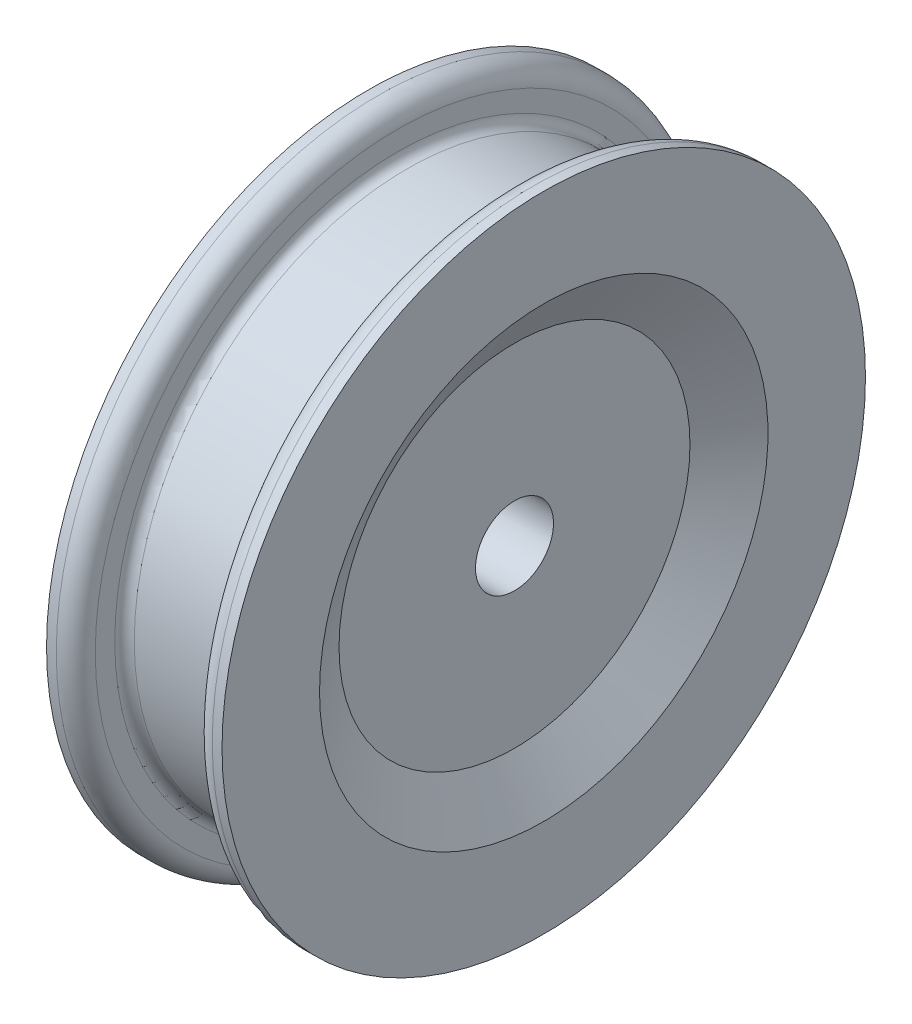
ISO-10303-21;
HEADER;
FILE_DESCRIPTION(('STEP AP214'),'2;1');
FILE_NAME('part.step','',(''),(''),'','','');
FILE_SCHEMA(('AUTOMOTIVE_DESIGN { 1 0 10303 214 1 1 1 1 }'));
ENDSEC;
DATA;
#1=APPLICATION_CONTEXT('core data for automotive mechanical design processes');
#2=APPLICATION_PROTOCOL_DEFINITION('international standard','automotive_design',2000,#1);
#3=PRODUCT_CONTEXT('',#1,'mechanical');
#4=PRODUCT('Part','Part','',(#3));
#5=PRODUCT_RELATED_PRODUCT_CATEGORY('part','',(#4));
#6=PRODUCT_DEFINITION_FORMATION('','',#4);
#7=PRODUCT_DEFINITION_CONTEXT('part definition',#1,'design');
#8=PRODUCT_DEFINITION('design','',#6,#7);
#9=PRODUCT_DEFINITION_SHAPE('','',#8);
#10=(LENGTH_UNIT() NAMED_UNIT(*) SI_UNIT(.MILLI.,.METRE.));
#11=(NAMED_UNIT(*) PLANE_ANGLE_UNIT() SI_UNIT($,.RADIAN.));
#12=(NAMED_UNIT(*) SI_UNIT($,.STERADIAN.) SOLID_ANGLE_UNIT());
#13=UNCERTAINTY_MEASURE_WITH_UNIT(LENGTH_MEASURE(1.E-05),#10,'distance_accuracy_value','');
#14=(GEOMETRIC_REPRESENTATION_CONTEXT(3) GLOBAL_UNCERTAINTY_ASSIGNED_CONTEXT((#13)) GLOBAL_UNIT_ASSIGNED_CONTEXT((#10,
#11,#12)) REPRESENTATION_CONTEXT('',''));
#15=CARTESIAN_POINT('',(0.,0.,0.));
#16=DIRECTION('',(0.,0.,1.));
#17=DIRECTION('',(1.,0.,0.));
#18=AXIS2_PLACEMENT_3D('',#15,#16,#17);
#19=CARTESIAN_POINT('',(1.5,4.5,0.));
#20=DIRECTION('',(-1.,0.,0.));
#21=DIRECTION('',(0.,0.,1.));
#22=AXIS2_PLACEMENT_3D('',#19,#20,#21);
#23=PLANE('',#22);
#24=CARTESIAN_POINT('',(1.5,0.,0.));
#25=DIRECTION('',(-1.,0.,0.));
#26=DIRECTION('',(0.,0.,1.));
#27=AXIS2_PLACEMENT_3D('',#24,#25,#26);
#28=CIRCLE('',#27,4.5);
#29=CARTESIAN_POINT('',(1.5,0.,4.5));
#30=VERTEX_POINT('',#29);
#31=EDGE_CURVE('E52',#30,#30,#28,.T.);
#32=ORIENTED_EDGE('',*,*,#31,.F.);
#33=EDGE_LOOP('',(#32));
#34=FACE_BOUND('',#33,.T.);
#35=CARTESIAN_POINT('',(1.5,0.,0.));
#36=DIRECTION('',(-1.,0.,0.));
#37=DIRECTION('',(0.,0.,1.));
#38=AXIS2_PLACEMENT_3D('',#35,#36,#37);
#39=CIRCLE('',#38,1.);
#40=CARTESIAN_POINT('',(1.5,0.,1.));
#41=VERTEX_POINT('',#40);
#42=EDGE_CURVE('E85',#41,#41,#39,.T.);
#43=ORIENTED_EDGE('',*,*,#42,.T.);
#44=EDGE_LOOP('',(#43));
#45=FACE_BOUND('',#44,.T.);
#46=ADVANCED_FACE('F32',(#34,#45),#23,.F.);
#47=CARTESIAN_POINT('',(1.5,0.,0.));
#48=DIRECTION('',(1.,0.,0.));
#49=DIRECTION('',(0.,0.,-1.));
#50=AXIS2_PLACEMENT_3D('',#47,#48,#49);
#51=CONICAL_SURFACE('',#50,4.5,1.03037682652431);
#52=CARTESIAN_POINT('',(2.25,0.,0.));
#53=DIRECTION('',(-1.,0.,0.));
#54=DIRECTION('',(0.,0.,1.));
#55=AXIS2_PLACEMENT_3D('',#52,#53,#54);
#56=CIRCLE('',#55,5.74999999999999);
#57=CARTESIAN_POINT('',(2.25,0.,5.74999999999999));
#58=VERTEX_POINT('',#57);
#59=EDGE_CURVE('E55',#58,#58,#56,.T.);
#60=ORIENTED_EDGE('',*,*,#59,.F.);
#61=EDGE_LOOP('',(#60));
#62=FACE_BOUND('',#61,.T.);
#63=ORIENTED_EDGE('',*,*,#31,.T.);
#64=EDGE_LOOP('',(#63));
#65=FACE_BOUND('',#64,.T.);
#66=ADVANCED_FACE('F127',(#62,#65),#51,.F.);
#67=CARTESIAN_POINT('',(2.25,8.24999999999999,0.));
#68=DIRECTION('',(-1.,0.,0.));
#69=DIRECTION('',(0.,0.,1.));
#70=AXIS2_PLACEMENT_3D('',#67,#68,#69);
#71=PLANE('',#70);
#72=CARTESIAN_POINT('',(2.25,0.,0.));
#73=DIRECTION('',(-1.,0.,0.));
#74=DIRECTION('',(0.,0.,1.));
#75=AXIS2_PLACEMENT_3D('',#72,#73,#74);
#76=CIRCLE('',#75,8.24999999999999);
#77=CARTESIAN_POINT('',(2.25,0.,8.24999999999999));
#78=VERTEX_POINT('',#77);
#79=EDGE_CURVE('E58',#78,#78,#76,.T.);
#80=ORIENTED_EDGE('',*,*,#79,.F.);
#81=EDGE_LOOP('',(#80));
#82=FACE_BOUND('',#81,.T.);
#83=ORIENTED_EDGE('',*,*,#59,.T.);
#84=EDGE_LOOP('',(#83));
#85=FACE_BOUND('',#84,.T.);
#86=ADVANCED_FACE('F133',(#82,#85),#71,.F.);
#87=CARTESIAN_POINT('',(0.,0.,0.));
#88=DIRECTION('',(-1.,0.,0.));
#89=DIRECTION('',(0.,0.,1.));
#90=AXIS2_PLACEMENT_3D('',#87,#88,#89);
#91=CYLINDRICAL_SURFACE('',#90,8.25);
#92=CARTESIAN_POINT('',(2.,0.,0.));
#93=DIRECTION('',(1.,0.,0.));
#94=DIRECTION('',(0.,0.,-1.));
#95=AXIS2_PLACEMENT_3D('',#92,#93,#94);
#96=CIRCLE('',#95,8.25);
#97=CARTESIAN_POINT('',(2.,0.,-8.25));
#98=VERTEX_POINT('',#97);
#99=EDGE_CURVE('E10',#98,#98,#96,.T.);
#100=ORIENTED_EDGE('',*,*,#99,.T.);
#101=EDGE_LOOP('',(#100));
#102=FACE_BOUND('',#101,.T.);
#103=ORIENTED_EDGE('',*,*,#79,.T.);
#104=EDGE_LOOP('',(#103));
#105=FACE_BOUND('',#104,.T.);
#106=ADVANCED_FACE('F169',(#102,#105),#91,.T.);
#107=CARTESIAN_POINT('',(1.5,8.25,0.));
#108=DIRECTION('',(1.,0.,0.));
#109=DIRECTION('',(0.,0.,-1.));
#110=AXIS2_PLACEMENT_3D('',#107,#108,#109);
#111=PLANE('',#110);
#112=CARTESIAN_POINT('',(1.5,0.,0.));
#113=DIRECTION('',(1.,0.,0.));
#114=DIRECTION('',(0.,0.,-1.));
#115=AXIS2_PLACEMENT_3D('',#112,#113,#114);
#116=CIRCLE('',#115,7.75);
#117=CARTESIAN_POINT('',(1.5,0.,-7.75));
#118=VERTEX_POINT('',#117);
#119=EDGE_CURVE('E39',#118,#118,#116,.F.);
#120=ORIENTED_EDGE('',*,*,#119,.T.);
#121=EDGE_LOOP('',(#120));
#122=FACE_BOUND('',#121,.T.);
#123=CARTESIAN_POINT('',(1.5,0.,0.));
#124=DIRECTION('',(-1.,0.,0.));
#125=DIRECTION('',(0.,0.,1.));
#126=AXIS2_PLACEMENT_3D('',#123,#124,#125);
#127=CIRCLE('',#126,7.25);
#128=CARTESIAN_POINT('',(1.5,0.,7.25));
#129=VERTEX_POINT('',#128);
#130=EDGE_CURVE('E61',#129,#129,#127,.T.);
#131=ORIENTED_EDGE('',*,*,#130,.F.);
#132=EDGE_LOOP('',(#131));
#133=FACE_BOUND('',#132,.T.);
#134=ADVANCED_FACE('F164',(#122,#133),#111,.F.);
#135=CARTESIAN_POINT('',(1.25,0.,0.));
#136=DIRECTION('',(-1.,0.,0.));
#137=DIRECTION('',(0.,0.,1.));
#138=AXIS2_PLACEMENT_3D('',#135,#136,#137);
#139=TOROIDAL_SURFACE('',#138,7.25,0.25);
#140=CARTESIAN_POINT('',(1.25,0.,0.));
#141=DIRECTION('',(-1.,0.,0.));
#142=DIRECTION('',(0.,0.,1.));
#143=AXIS2_PLACEMENT_3D('',#140,#141,#142);
#144=CIRCLE('',#143,7.);
#145=CARTESIAN_POINT('',(1.25,0.,7.));
#146=VERTEX_POINT('',#145);
#147=EDGE_CURVE('E64',#146,#146,#144,.T.);
#148=ORIENTED_EDGE('',*,*,#147,.F.);
#149=EDGE_LOOP('',(#148));
#150=FACE_BOUND('',#149,.T.);
#151=ORIENTED_EDGE('',*,*,#130,.T.);
#152=EDGE_LOOP('',(#151));
#153=FACE_BOUND('',#152,.T.);
#154=ADVANCED_FACE('F158',(#150,#153),#139,.F.);
#155=CARTESIAN_POINT('',(0.,0.,0.));
#156=DIRECTION('',(-1.,0.,0.));
#157=DIRECTION('',(0.,0.,1.));
#158=AXIS2_PLACEMENT_3D('',#155,#156,#157);
#159=CYLINDRICAL_SURFACE('',#158,7.);
#160=CARTESIAN_POINT('',(-1.25,0.,0.));
#161=DIRECTION('',(-1.,0.,0.));
#162=DIRECTION('',(0.,0.,1.));
#163=AXIS2_PLACEMENT_3D('',#160,#161,#162);
#164=CIRCLE('',#163,7.);
#165=CARTESIAN_POINT('',(-1.25,0.,7.));
#166=VERTEX_POINT('',#165);
#167=EDGE_CURVE('E67',#166,#166,#164,.T.);
#168=ORIENTED_EDGE('',*,*,#167,.F.);
#169=EDGE_LOOP('',(#168));
#170=FACE_BOUND('',#169,.T.);
#171=ORIENTED_EDGE('',*,*,#147,.T.);
#172=EDGE_LOOP('',(#171));
#173=FACE_BOUND('',#172,.T.);
#174=ADVANCED_FACE('F152',(#170,#173),#159,.T.);
#175=CARTESIAN_POINT('',(-1.25,0.,0.));
#176=DIRECTION('',(-1.,0.,0.));
#177=DIRECTION('',(0.,0.,1.));
#178=AXIS2_PLACEMENT_3D('',#175,#176,#177);
#179=TOROIDAL_SURFACE('',#178,7.25,0.25);
#180=CARTESIAN_POINT('',(-1.5,0.,0.));
#181=DIRECTION('',(-1.,0.,0.));
#182=DIRECTION('',(0.,0.,1.));
#183=AXIS2_PLACEMENT_3D('',#180,#181,#182);
#184=CIRCLE('',#183,7.25);
#185=CARTESIAN_POINT('',(-1.5,0.,7.25));
#186=VERTEX_POINT('',#185);
#187=EDGE_CURVE('E70',#186,#186,#184,.T.);
#188=ORIENTED_EDGE('',*,*,#187,.F.);
#189=EDGE_LOOP('',(#188));
#190=FACE_BOUND('',#189,.T.);
#191=ORIENTED_EDGE('',*,*,#167,.T.);
#192=EDGE_LOOP('',(#191));
#193=FACE_BOUND('',#192,.T.);
#194=ADVANCED_FACE('F123',(#190,#193),#179,.F.);
#195=CARTESIAN_POINT('',(-1.5,8.25,0.));
#196=DIRECTION('',(-1.,0.,0.));
#197=DIRECTION('',(0.,0.,1.));
#198=AXIS2_PLACEMENT_3D('',#195,#196,#197);
#199=PLANE('',#198);
#200=CARTESIAN_POINT('',(-1.5,0.,0.));
#201=DIRECTION('',(-1.,0.,0.));
#202=DIRECTION('',(0.,0.,1.));
#203=AXIS2_PLACEMENT_3D('',#200,#201,#202);
#204=CIRCLE('',#203,7.75);
#205=CARTESIAN_POINT('',(-1.5,0.,7.75));
#206=VERTEX_POINT('',#205);
#207=EDGE_CURVE('E43',#206,#206,#204,.F.);
#208=ORIENTED_EDGE('',*,*,#207,.T.);
#209=EDGE_LOOP('',(#208));
#210=FACE_BOUND('',#209,.T.);
#211=ORIENTED_EDGE('',*,*,#187,.T.);
#212=EDGE_LOOP('',(#211));
#213=FACE_BOUND('',#212,.T.);
#214=ADVANCED_FACE('F117',(#210,#213),#199,.F.);
#215=CARTESIAN_POINT('',(0.,0.,0.));
#216=DIRECTION('',(-1.,0.,0.));
#217=DIRECTION('',(0.,0.,1.));
#218=AXIS2_PLACEMENT_3D('',#215,#216,#217);
#219=CYLINDRICAL_SURFACE('',#218,8.25);
#220=CARTESIAN_POINT('',(-2.,0.,0.));
#221=DIRECTION('',(-1.,0.,0.));
#222=DIRECTION('',(0.,0.,1.));
#223=AXIS2_PLACEMENT_3D('',#220,#221,#222);
#224=CIRCLE('',#223,8.25);
#225=CARTESIAN_POINT('',(-2.,0.,8.25));
#226=VERTEX_POINT('',#225);
#227=EDGE_CURVE('E47',#226,#226,#224,.T.);
#228=ORIENTED_EDGE('',*,*,#227,.T.);
#229=EDGE_LOOP('',(#228));
#230=FACE_BOUND('',#229,.T.);
#231=CARTESIAN_POINT('',(-2.25,0.,0.));
#232=DIRECTION('',(-1.,0.,0.));
#233=DIRECTION('',(0.,0.,1.));
#234=AXIS2_PLACEMENT_3D('',#231,#232,#233);
#235=CIRCLE('',#234,8.24999999999999);
#236=CARTESIAN_POINT('',(-2.25,0.,8.24999999999999));
#237=VERTEX_POINT('',#236);
#238=EDGE_CURVE('E73',#237,#237,#235,.T.);
#239=ORIENTED_EDGE('',*,*,#238,.F.);
#240=EDGE_LOOP('',(#239));
#241=FACE_BOUND('',#240,.T.);
#242=ADVANCED_FACE('F112',(#230,#241),#219,.T.);
#243=CARTESIAN_POINT('',(-2.25,8.24999999999999,0.));
#244=DIRECTION('',(1.,0.,0.));
#245=DIRECTION('',(0.,0.,-1.));
#246=AXIS2_PLACEMENT_3D('',#243,#244,#245);
#247=PLANE('',#246);
#248=CARTESIAN_POINT('',(-2.25,0.,0.));
#249=DIRECTION('',(-1.,0.,0.));
#250=DIRECTION('',(0.,0.,1.));
#251=AXIS2_PLACEMENT_3D('',#248,#249,#250);
#252=CIRCLE('',#251,5.74999999999999);
#253=CARTESIAN_POINT('',(-2.25,0.,5.74999999999999));
#254=VERTEX_POINT('',#253);
#255=EDGE_CURVE('E76',#254,#254,#252,.T.);
#256=ORIENTED_EDGE('',*,*,#255,.F.);
#257=EDGE_LOOP('',(#256));
#258=FACE_BOUND('',#257,.T.);
#259=ORIENTED_EDGE('',*,*,#238,.T.);
#260=EDGE_LOOP('',(#259));
#261=FACE_BOUND('',#260,.T.);
#262=ADVANCED_FACE('F106',(#258,#261),#247,.F.);
#263=CARTESIAN_POINT('',(-2.25,0.,0.));
#264=DIRECTION('',(-1.,0.,0.));
#265=DIRECTION('',(0.,0.,1.));
#266=AXIS2_PLACEMENT_3D('',#263,#264,#265);
#267=CONICAL_SURFACE('',#266,5.74999999999999,1.03037682652431);
#268=CARTESIAN_POINT('',(-1.5,0.,0.));
#269=DIRECTION('',(-1.,0.,0.));
#270=DIRECTION('',(0.,0.,1.));
#271=AXIS2_PLACEMENT_3D('',#268,#269,#270);
#272=CIRCLE('',#271,4.5);
#273=CARTESIAN_POINT('',(-1.5,0.,4.5));
#274=VERTEX_POINT('',#273);
#275=EDGE_CURVE('E79',#274,#274,#272,.T.);
#276=ORIENTED_EDGE('',*,*,#275,.F.);
#277=EDGE_LOOP('',(#276));
#278=FACE_BOUND('',#277,.T.);
#279=ORIENTED_EDGE('',*,*,#255,.T.);
#280=EDGE_LOOP('',(#279));
#281=FACE_BOUND('',#280,.T.);
#282=ADVANCED_FACE('F100',(#278,#281),#267,.F.);
#283=CARTESIAN_POINT('',(-1.5,4.5,0.));
#284=DIRECTION('',(1.,0.,0.));
#285=DIRECTION('',(0.,0.,-1.));
#286=AXIS2_PLACEMENT_3D('',#283,#284,#285);
#287=PLANE('',#286);
#288=CARTESIAN_POINT('',(-1.5,0.,0.));
#289=DIRECTION('',(-1.,0.,0.));
#290=DIRECTION('',(0.,0.,1.));
#291=AXIS2_PLACEMENT_3D('',#288,#289,#290);
#292=CIRCLE('',#291,1.);
#293=CARTESIAN_POINT('',(-1.5,0.,1.));
#294=VERTEX_POINT('',#293);
#295=EDGE_CURVE('E82',#294,#294,#292,.T.);
#296=ORIENTED_EDGE('',*,*,#295,.F.);
#297=EDGE_LOOP('',(#296));
#298=FACE_BOUND('',#297,.T.);
#299=ORIENTED_EDGE('',*,*,#275,.T.);
#300=EDGE_LOOP('',(#299));
#301=FACE_BOUND('',#300,.T.);
#302=ADVANCED_FACE('F94',(#298,#301),#287,.F.);
#303=CARTESIAN_POINT('',(0.,0.,0.));
#304=DIRECTION('',(-1.,0.,0.));
#305=DIRECTION('',(0.,0.,1.));
#306=AXIS2_PLACEMENT_3D('',#303,#304,#305);
#307=CYLINDRICAL_SURFACE('',#306,1.);
#308=ORIENTED_EDGE('',*,*,#42,.F.);
#309=EDGE_LOOP('',(#308));
#310=FACE_BOUND('',#309,.T.);
#311=ORIENTED_EDGE('',*,*,#295,.T.);
#312=EDGE_LOOP('',(#311));
#313=FACE_BOUND('',#312,.T.);
#314=ADVANCED_FACE('F90',(#310,#313),#307,.F.);
#315=CARTESIAN_POINT('',(-2.,0.,0.));
#316=DIRECTION('',(-1.,0.,0.));
#317=DIRECTION('',(0.,0.,1.));
#318=AXIS2_PLACEMENT_3D('',#315,#316,#317);
#319=TOROIDAL_SURFACE('',#318,7.75,0.5);
#320=ORIENTED_EDGE('',*,*,#207,.F.);
#321=EDGE_LOOP('',(#320));
#322=FACE_BOUND('',#321,.T.);
#323=ORIENTED_EDGE('',*,*,#227,.F.);
#324=EDGE_LOOP('',(#323));
#325=FACE_BOUND('',#324,.T.);
#326=ADVANCED_FACE('F93',(#322,#325),#319,.T.);
#327=CARTESIAN_POINT('',(2.,0.,0.));
#328=DIRECTION('',(1.,0.,0.));
#329=DIRECTION('',(0.,0.,-1.));
#330=AXIS2_PLACEMENT_3D('',#327,#328,#329);
#331=TOROIDAL_SURFACE('',#330,7.75,0.5);
#332=ORIENTED_EDGE('',*,*,#99,.F.);
#333=EDGE_LOOP('',(#332));
#334=FACE_BOUND('',#333,.T.);
#335=ORIENTED_EDGE('',*,*,#119,.F.);
#336=EDGE_LOOP('',(#335));
#337=FACE_BOUND('',#336,.T.);
#338=ADVANCED_FACE('F34',(#334,#337),#331,.T.);
#339=CLOSED_SHELL('',(#46,#66,#86,#106,#134,#154,#174,#194,#214,#242,#262,#282,#302,#314,#326,#338));
#340=MANIFOLD_SOLID_BREP('B2',#339);
#341=ADVANCED_BREP_SHAPE_REPRESENTATION('',(#18,#340),#14);
#342=SHAPE_DEFINITION_REPRESENTATION(#9,#341);
ENDSEC;
END-ISO-10303-21;
